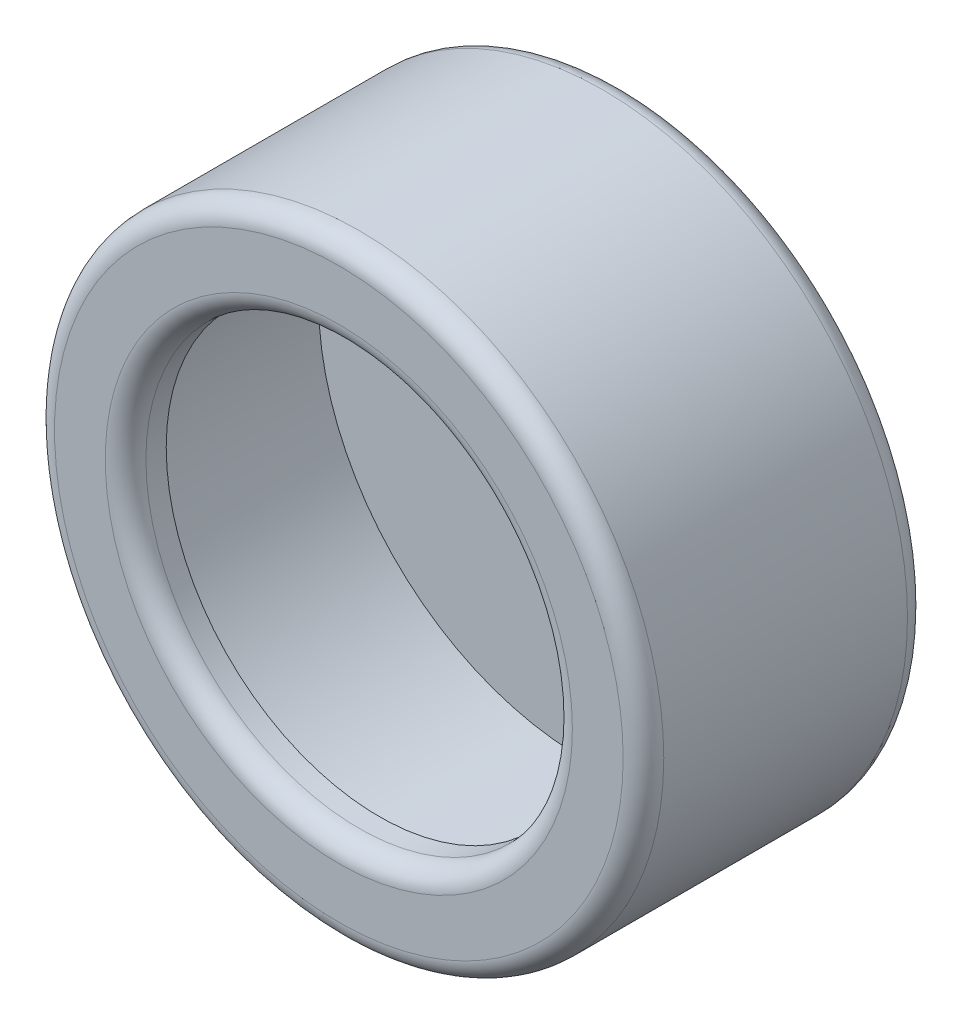
ISO-10303-21;
HEADER;
FILE_DESCRIPTION(('STEP AP214'),'2;1');
FILE_NAME('part.step','',(''),(''),'','','');
FILE_SCHEMA(('AUTOMOTIVE_DESIGN { 1 0 10303 214 1 1 1 1 }'));
ENDSEC;
DATA;
#1=APPLICATION_CONTEXT('core data for automotive mechanical design processes');
#2=APPLICATION_PROTOCOL_DEFINITION('international standard','automotive_design',2000,#1);
#3=PRODUCT_CONTEXT('',#1,'mechanical');
#4=PRODUCT('Part','Part','',(#3));
#5=PRODUCT_RELATED_PRODUCT_CATEGORY('part','',(#4));
#6=PRODUCT_DEFINITION_FORMATION('','',#4);
#7=PRODUCT_DEFINITION_CONTEXT('part definition',#1,'design');
#8=PRODUCT_DEFINITION('design','',#6,#7);
#9=PRODUCT_DEFINITION_SHAPE('','',#8);
#10=(LENGTH_UNIT() NAMED_UNIT(*) SI_UNIT(.MILLI.,.METRE.));
#11=(NAMED_UNIT(*) PLANE_ANGLE_UNIT() SI_UNIT($,.RADIAN.));
#12=(NAMED_UNIT(*) SI_UNIT($,.STERADIAN.) SOLID_ANGLE_UNIT());
#13=UNCERTAINTY_MEASURE_WITH_UNIT(LENGTH_MEASURE(1.E-05),#10,'distance_accuracy_value','');
#14=(GEOMETRIC_REPRESENTATION_CONTEXT(3) GLOBAL_UNCERTAINTY_ASSIGNED_CONTEXT((#13)) GLOBAL_UNIT_ASSIGNED_CONTEXT((#10,
#11,#12)) REPRESENTATION_CONTEXT('',''));
#15=CARTESIAN_POINT('',(0.,0.,0.));
#16=DIRECTION('',(0.,0.,1.));
#17=DIRECTION('',(1.,0.,0.));
#18=AXIS2_PLACEMENT_3D('',#15,#16,#17);
#19=CARTESIAN_POINT('',(0.,0.,7.));
#20=DIRECTION('',(0.,0.,-1.));
#21=DIRECTION('',(-1.,0.,0.));
#22=AXIS2_PLACEMENT_3D('',#19,#20,#21);
#23=CYLINDRICAL_SURFACE('',#22,7.5);
#24=CARTESIAN_POINT('',(0.,0.,6.5));
#25=DIRECTION('',(0.,0.,1.));
#26=DIRECTION('',(1.,0.,0.));
#27=AXIS2_PLACEMENT_3D('',#24,#25,#26);
#28=CIRCLE('',#27,7.5);
#29=CARTESIAN_POINT('',(7.5,0.,6.5));
#30=VERTEX_POINT('',#29);
#31=EDGE_CURVE('E38',#30,#30,#28,.F.);
#32=ORIENTED_EDGE('',*,*,#31,.T.);
#33=EDGE_LOOP('',(#32));
#34=FACE_BOUND('',#33,.T.);
#35=CARTESIAN_POINT('',(0.,0.,0.5));
#36=DIRECTION('',(0.,0.,1.));
#37=DIRECTION('',(1.,0.,0.));
#38=AXIS2_PLACEMENT_3D('',#35,#36,#37);
#39=CIRCLE('',#38,7.5);
#40=CARTESIAN_POINT('',(7.5,0.,0.5));
#41=VERTEX_POINT('',#40);
#42=EDGE_CURVE('E42',#41,#41,#39,.T.);
#43=ORIENTED_EDGE('',*,*,#42,.T.);
#44=EDGE_LOOP('',(#43));
#45=FACE_BOUND('',#44,.T.);
#46=ADVANCED_FACE('F31',(#34,#45),#23,.T.);
#47=CARTESIAN_POINT('',(0.,0.,7.));
#48=DIRECTION('',(0.,0.,1.));
#49=DIRECTION('',(1.,0.,0.));
#50=AXIS2_PLACEMENT_3D('',#47,#48,#49);
#51=PLANE('',#50);
#52=CARTESIAN_POINT('',(0.,0.,7.));
#53=DIRECTION('',(0.,0.,1.));
#54=DIRECTION('',(1.,0.,0.));
#55=AXIS2_PLACEMENT_3D('',#52,#53,#54);
#56=CIRCLE('',#55,5.75);
#57=CARTESIAN_POINT('',(5.75,0.,7.));
#58=VERTEX_POINT('',#57);
#59=EDGE_CURVE('E46',#58,#58,#56,.F.);
#60=ORIENTED_EDGE('',*,*,#59,.T.);
#61=EDGE_LOOP('',(#60));
#62=FACE_BOUND('',#61,.T.);
#63=CARTESIAN_POINT('',(0.,0.,7.));
#64=DIRECTION('',(0.,0.,1.));
#65=DIRECTION('',(1.,0.,0.));
#66=AXIS2_PLACEMENT_3D('',#63,#64,#65);
#67=CIRCLE('',#66,7.);
#68=CARTESIAN_POINT('',(7.,0.,7.));
#69=VERTEX_POINT('',#68);
#70=EDGE_CURVE('E51',#69,#69,#67,.T.);
#71=ORIENTED_EDGE('',*,*,#70,.T.);
#72=EDGE_LOOP('',(#71));
#73=FACE_BOUND('',#72,.T.);
#74=ADVANCED_FACE('F84',(#62,#73),#51,.T.);
#75=CARTESIAN_POINT('',(0.,0.,0.));
#76=DIRECTION('',(0.,0.,1.));
#77=DIRECTION('',(1.,0.,0.));
#78=AXIS2_PLACEMENT_3D('',#75,#76,#77);
#79=PLANE('',#78);
#80=CARTESIAN_POINT('',(0.,0.,0.));
#81=DIRECTION('',(0.,0.,1.));
#82=DIRECTION('',(1.,0.,0.));
#83=AXIS2_PLACEMENT_3D('',#80,#81,#82);
#84=CIRCLE('',#83,7.);
#85=CARTESIAN_POINT('',(7.,0.,0.));
#86=VERTEX_POINT('',#85);
#87=EDGE_CURVE('E10',#86,#86,#84,.F.);
#88=ORIENTED_EDGE('',*,*,#87,.T.);
#89=EDGE_LOOP('',(#88));
#90=FACE_BOUND('',#89,.T.);
#91=ADVANCED_FACE('F78',(#90),#79,.F.);
#92=CARTESIAN_POINT('',(0.,0.,1.));
#93=DIRECTION('',(0.,0.,1.));
#94=DIRECTION('',(1.,0.,0.));
#95=AXIS2_PLACEMENT_3D('',#92,#93,#94);
#96=CYLINDRICAL_SURFACE('',#95,5.25);
#97=CARTESIAN_POINT('',(0.,0.,6.5));
#98=DIRECTION('',(0.,0.,1.));
#99=DIRECTION('',(1.,0.,0.));
#100=AXIS2_PLACEMENT_3D('',#97,#98,#99);
#101=CIRCLE('',#100,5.25);
#102=CARTESIAN_POINT('',(5.25,0.,6.5));
#103=VERTEX_POINT('',#102);
#104=EDGE_CURVE('E54',#103,#103,#101,.T.);
#105=ORIENTED_EDGE('',*,*,#104,.T.);
#106=EDGE_LOOP('',(#105));
#107=FACE_BOUND('',#106,.T.);
#108=CARTESIAN_POINT('',(0.,0.,6.));
#109=DIRECTION('',(0.,0.,1.));
#110=DIRECTION('',(1.,0.,0.));
#111=AXIS2_PLACEMENT_3D('',#108,#109,#110);
#112=CIRCLE('',#111,5.25);
#113=CARTESIAN_POINT('',(5.25,0.,6.));
#114=VERTEX_POINT('',#113);
#115=EDGE_CURVE('E57',#114,#114,#112,.F.);
#116=ORIENTED_EDGE('',*,*,#115,.T.);
#117=EDGE_LOOP('',(#116));
#118=FACE_BOUND('',#117,.T.);
#119=ADVANCED_FACE('F73',(#107,#118),#96,.F.);
#120=CARTESIAN_POINT('',(0.,0.,6.));
#121=DIRECTION('',(0.,0.,1.));
#122=DIRECTION('',(1.,0.,0.));
#123=AXIS2_PLACEMENT_3D('',#120,#121,#122);
#124=PLANE('',#123);
#125=CARTESIAN_POINT('',(0.,0.,6.));
#126=DIRECTION('',(0.,0.,1.));
#127=DIRECTION('',(1.,0.,0.));
#128=AXIS2_PLACEMENT_3D('',#125,#126,#127);
#129=CIRCLE('',#128,6.5);
#130=CARTESIAN_POINT('',(6.5,0.,6.));
#131=VERTEX_POINT('',#130);
#132=EDGE_CURVE('E60',#131,#131,#129,.T.);
#133=ORIENTED_EDGE('',*,*,#132,.F.);
#134=EDGE_LOOP('',(#133));
#135=FACE_BOUND('',#134,.T.);
#136=ORIENTED_EDGE('',*,*,#115,.F.);
#137=EDGE_LOOP('',(#136));
#138=FACE_BOUND('',#137,.T.);
#139=ADVANCED_FACE('F70',(#135,#138),#124,.F.);
#140=CARTESIAN_POINT('',(0.,0.,6.));
#141=DIRECTION('',(0.,0.,-1.));
#142=DIRECTION('',(-1.,0.,0.));
#143=AXIS2_PLACEMENT_3D('',#140,#141,#142);
#144=CYLINDRICAL_SURFACE('',#143,6.5);
#145=ORIENTED_EDGE('',*,*,#132,.T.);
#146=EDGE_LOOP('',(#145));
#147=FACE_BOUND('',#146,.T.);
#148=CARTESIAN_POINT('',(0.,0.,1.));
#149=DIRECTION('',(0.,0.,1.));
#150=DIRECTION('',(1.,0.,0.));
#151=AXIS2_PLACEMENT_3D('',#148,#149,#150);
#152=CIRCLE('',#151,6.5);
#153=CARTESIAN_POINT('',(6.5,0.,1.));
#154=VERTEX_POINT('',#153);
#155=EDGE_CURVE('E61',#154,#154,#152,.T.);
#156=ORIENTED_EDGE('',*,*,#155,.F.);
#157=EDGE_LOOP('',(#156));
#158=FACE_BOUND('',#157,.T.);
#159=ADVANCED_FACE('F67',(#147,#158),#144,.F.);
#160=CARTESIAN_POINT('',(0.,0.,1.));
#161=DIRECTION('',(0.,0.,1.));
#162=DIRECTION('',(1.,0.,0.));
#163=AXIS2_PLACEMENT_3D('',#160,#161,#162);
#164=PLANE('',#163);
#165=ORIENTED_EDGE('',*,*,#155,.T.);
#166=EDGE_LOOP('',(#165));
#167=FACE_BOUND('',#166,.T.);
#168=ADVANCED_FACE('F99',(#167),#164,.T.);
#169=CARTESIAN_POINT('',(0.,0.,6.5));
#170=DIRECTION('',(0.,0.,1.));
#171=DIRECTION('',(1.,0.,0.));
#172=AXIS2_PLACEMENT_3D('',#169,#170,#171);
#173=TOROIDAL_SURFACE('',#172,5.75,0.5);
#174=ORIENTED_EDGE('',*,*,#59,.F.);
#175=EDGE_LOOP('',(#174));
#176=FACE_BOUND('',#175,.T.);
#177=ORIENTED_EDGE('',*,*,#104,.F.);
#178=EDGE_LOOP('',(#177));
#179=FACE_BOUND('',#178,.T.);
#180=ADVANCED_FACE('F96',(#176,#179),#173,.T.);
#181=CARTESIAN_POINT('',(0.,0.,6.5));
#182=DIRECTION('',(0.,0.,1.));
#183=DIRECTION('',(1.,0.,0.));
#184=AXIS2_PLACEMENT_3D('',#181,#182,#183);
#185=TOROIDAL_SURFACE('',#184,7.,0.5);
#186=ORIENTED_EDGE('',*,*,#31,.F.);
#187=EDGE_LOOP('',(#186));
#188=FACE_BOUND('',#187,.T.);
#189=ORIENTED_EDGE('',*,*,#70,.F.);
#190=EDGE_LOOP('',(#189));
#191=FACE_BOUND('',#190,.T.);
#192=ADVANCED_FACE('F98',(#188,#191),#185,.T.);
#193=CARTESIAN_POINT('',(0.,0.,0.5));
#194=DIRECTION('',(0.,0.,1.));
#195=DIRECTION('',(1.,0.,0.));
#196=AXIS2_PLACEMENT_3D('',#193,#194,#195);
#197=TOROIDAL_SURFACE('',#196,7.,0.5);
#198=ORIENTED_EDGE('',*,*,#87,.F.);
#199=EDGE_LOOP('',(#198));
#200=FACE_BOUND('',#199,.T.);
#201=ORIENTED_EDGE('',*,*,#42,.F.);
#202=EDGE_LOOP('',(#201));
#203=FACE_BOUND('',#202,.T.);
#204=ADVANCED_FACE('F33',(#200,#203),#197,.T.);
#205=CLOSED_SHELL('',(#46,#74,#91,#119,#139,#159,#168,#180,#192,#204));
#206=MANIFOLD_SOLID_BREP('B2',#205);
#207=ADVANCED_BREP_SHAPE_REPRESENTATION('',(#18,#206),#14);
#208=SHAPE_DEFINITION_REPRESENTATION(#9,#207);
ENDSEC;
END-ISO-10303-21;
